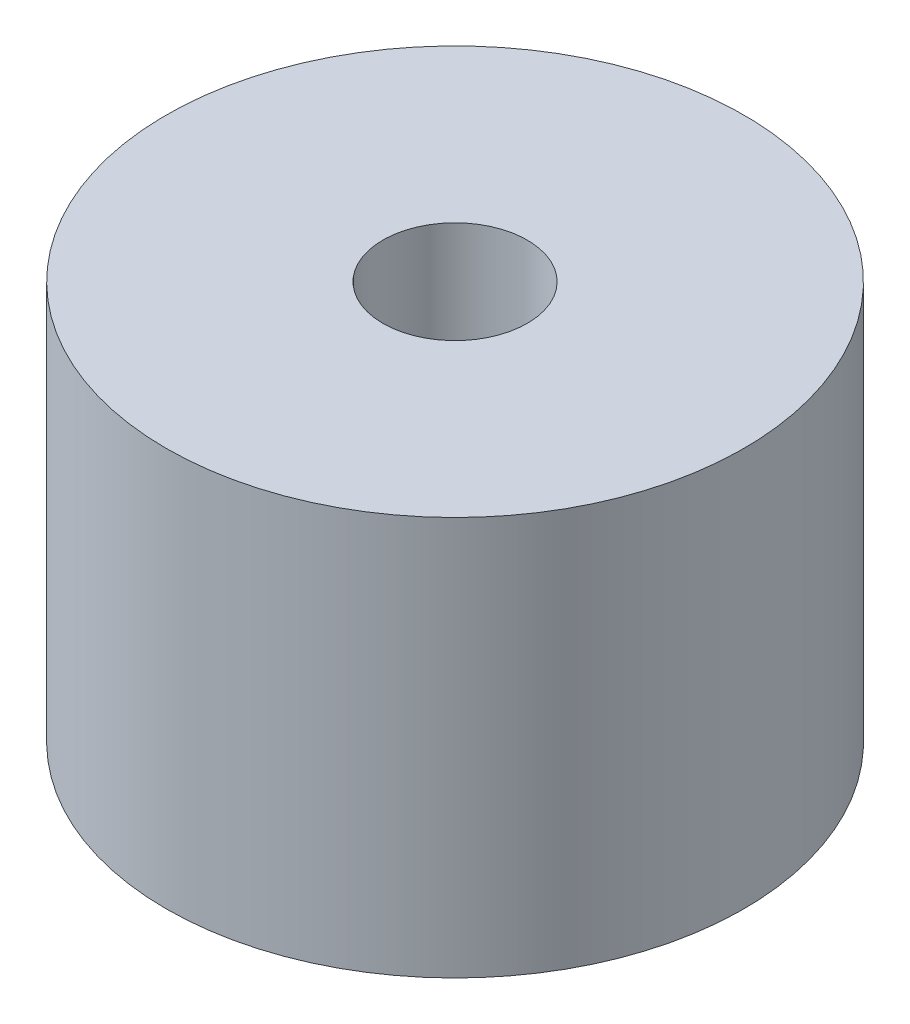
ISO-10303-21;
HEADER;
FILE_DESCRIPTION(('STEP AP214'),'2;1');
FILE_NAME('part.step','',(''),(''),'','','');
FILE_SCHEMA(('AUTOMOTIVE_DESIGN { 1 0 10303 214 1 1 1 1 }'));
ENDSEC;
DATA;
#1=APPLICATION_CONTEXT('core data for automotive mechanical design processes');
#2=APPLICATION_PROTOCOL_DEFINITION('international standard','automotive_design',2000,#1);
#3=PRODUCT_CONTEXT('',#1,'mechanical');
#4=PRODUCT('Part','Part','',(#3));
#5=PRODUCT_RELATED_PRODUCT_CATEGORY('part','',(#4));
#6=PRODUCT_DEFINITION_FORMATION('','',#4);
#7=PRODUCT_DEFINITION_CONTEXT('part definition',#1,'design');
#8=PRODUCT_DEFINITION('design','',#6,#7);
#9=PRODUCT_DEFINITION_SHAPE('','',#8);
#10=(LENGTH_UNIT() NAMED_UNIT(*) SI_UNIT(.MILLI.,.METRE.));
#11=(NAMED_UNIT(*) PLANE_ANGLE_UNIT() SI_UNIT($,.RADIAN.));
#12=(NAMED_UNIT(*) SI_UNIT($,.STERADIAN.) SOLID_ANGLE_UNIT());
#13=UNCERTAINTY_MEASURE_WITH_UNIT(LENGTH_MEASURE(1.E-05),#10,'distance_accuracy_value','');
#14=(GEOMETRIC_REPRESENTATION_CONTEXT(3) GLOBAL_UNCERTAINTY_ASSIGNED_CONTEXT((#13)) GLOBAL_UNIT_ASSIGNED_CONTEXT((#10,
#11,#12)) REPRESENTATION_CONTEXT('',''));
#15=CARTESIAN_POINT('',(0.,0.,0.));
#16=DIRECTION('',(0.,0.,1.));
#17=DIRECTION('',(1.,0.,0.));
#18=AXIS2_PLACEMENT_3D('',#15,#16,#17);
#19=CARTESIAN_POINT('',(0.,2.9,0.));
#20=DIRECTION('',(0.,-1.,0.));
#21=DIRECTION('',(0.,0.,-1.));
#22=AXIS2_PLACEMENT_3D('',#19,#20,#21);
#23=CYLINDRICAL_SURFACE('',#22,4.2);
#24=CARTESIAN_POINT('',(0.,2.9,0.));
#25=DIRECTION('',(0.,1.,0.));
#26=DIRECTION('',(0.,0.,1.));
#27=AXIS2_PLACEMENT_3D('',#24,#25,#26);
#28=CIRCLE('',#27,4.2);
#29=CARTESIAN_POINT('',(0.,2.9,4.2));
#30=VERTEX_POINT('',#29);
#31=EDGE_CURVE('E10',#30,#30,#28,.T.);
#32=ORIENTED_EDGE('',*,*,#31,.F.);
#33=EDGE_LOOP('',(#32));
#34=FACE_BOUND('',#33,.T.);
#35=CARTESIAN_POINT('',(0.,-2.9,0.));
#36=DIRECTION('',(0.,1.,0.));
#37=DIRECTION('',(0.,0.,1.));
#38=AXIS2_PLACEMENT_3D('',#35,#36,#37);
#39=CIRCLE('',#38,4.2);
#40=CARTESIAN_POINT('',(0.,-2.9,4.2));
#41=VERTEX_POINT('',#40);
#42=EDGE_CURVE('E33',#41,#41,#39,.T.);
#43=ORIENTED_EDGE('',*,*,#42,.T.);
#44=EDGE_LOOP('',(#43));
#45=FACE_BOUND('',#44,.T.);
#46=ADVANCED_FACE('F30',(#34,#45),#23,.T.);
#47=CARTESIAN_POINT('',(0.,2.9,0.));
#48=DIRECTION('',(0.,1.,0.));
#49=DIRECTION('',(0.,0.,1.));
#50=AXIS2_PLACEMENT_3D('',#47,#48,#49);
#51=PLANE('',#50);
#52=CARTESIAN_POINT('',(0.,2.9,0.));
#53=DIRECTION('',(0.,1.,0.));
#54=DIRECTION('',(0.,0.,1.));
#55=AXIS2_PLACEMENT_3D('',#52,#53,#54);
#56=CIRCLE('',#55,1.05);
#57=CARTESIAN_POINT('',(0.,2.9,1.05));
#58=VERTEX_POINT('',#57);
#59=EDGE_CURVE('E44',#58,#58,#56,.T.);
#60=ORIENTED_EDGE('',*,*,#59,.F.);
#61=EDGE_LOOP('',(#60));
#62=FACE_BOUND('',#61,.T.);
#63=ORIENTED_EDGE('',*,*,#31,.T.);
#64=EDGE_LOOP('',(#63));
#65=FACE_BOUND('',#64,.T.);
#66=ADVANCED_FACE('F50',(#62,#65),#51,.T.);
#67=CARTESIAN_POINT('',(0.,-2.9,0.));
#68=DIRECTION('',(0.,1.,0.));
#69=DIRECTION('',(0.,0.,1.));
#70=AXIS2_PLACEMENT_3D('',#67,#68,#69);
#71=PLANE('',#70);
#72=CARTESIAN_POINT('',(0.,-2.9,0.));
#73=DIRECTION('',(0.,1.,0.));
#74=DIRECTION('',(0.,0.,1.));
#75=AXIS2_PLACEMENT_3D('',#72,#73,#74);
#76=CIRCLE('',#75,1.05);
#77=CARTESIAN_POINT('',(0.,-2.9,1.05));
#78=VERTEX_POINT('',#77);
#79=EDGE_CURVE('E40',#78,#78,#76,.T.);
#80=ORIENTED_EDGE('',*,*,#79,.T.);
#81=EDGE_LOOP('',(#80));
#82=FACE_BOUND('',#81,.T.);
#83=ORIENTED_EDGE('',*,*,#42,.F.);
#84=EDGE_LOOP('',(#83));
#85=FACE_BOUND('',#84,.T.);
#86=ADVANCED_FACE('F52',(#82,#85),#71,.F.);
#87=CARTESIAN_POINT('',(0.,2.9,0.));
#88=DIRECTION('',(0.,1.,0.));
#89=DIRECTION('',(0.,0.,1.));
#90=AXIS2_PLACEMENT_3D('',#87,#88,#89);
#91=CYLINDRICAL_SURFACE('',#90,1.05);
#92=ORIENTED_EDGE('',*,*,#79,.F.);
#93=EDGE_LOOP('',(#92));
#94=FACE_BOUND('',#93,.T.);
#95=ORIENTED_EDGE('',*,*,#59,.T.);
#96=EDGE_LOOP('',(#95));
#97=FACE_BOUND('',#96,.T.);
#98=ADVANCED_FACE('F48',(#94,#97),#91,.F.);
#99=CLOSED_SHELL('',(#46,#66,#86,#98));
#100=MANIFOLD_SOLID_BREP('B2',#99);
#101=ADVANCED_BREP_SHAPE_REPRESENTATION('',(#18,#100),#14);
#102=SHAPE_DEFINITION_REPRESENTATION(#9,#101);
ENDSEC;
END-ISO-10303-21;
